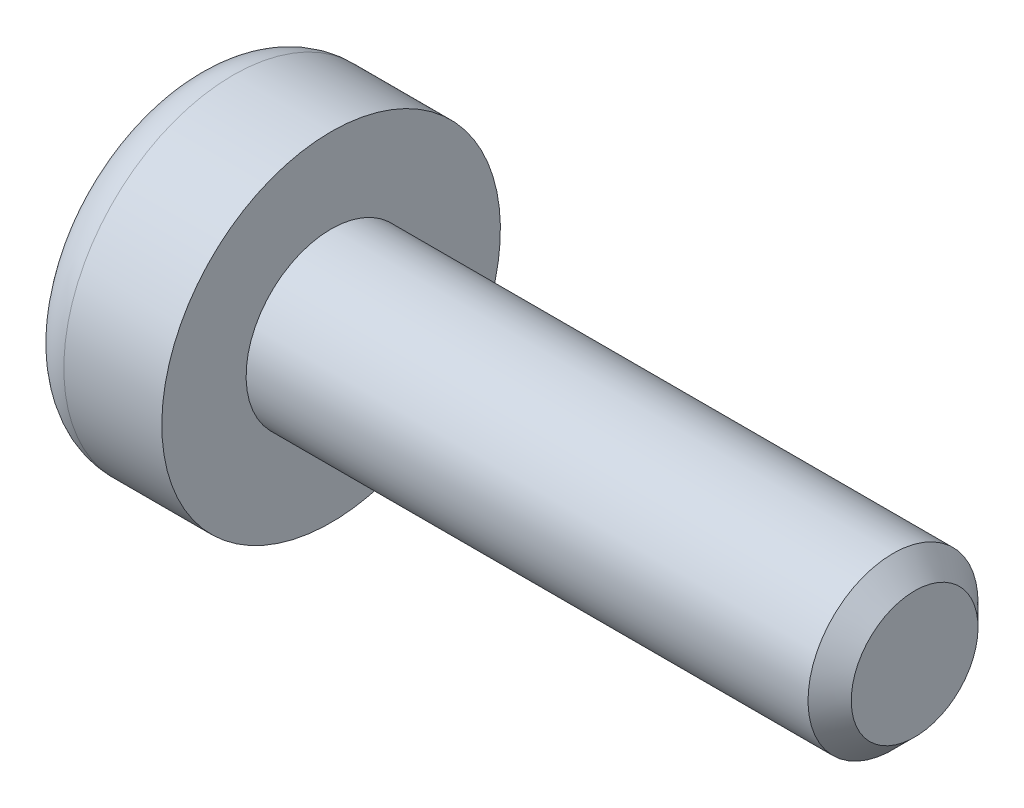
ISO-10303-21;
HEADER;
FILE_DESCRIPTION(('STEP AP214'),'2;1');
FILE_NAME('part.step','',(''),(''),'','','');
FILE_SCHEMA(('AUTOMOTIVE_DESIGN { 1 0 10303 214 1 1 1 1 }'));
ENDSEC;
DATA;
#1=APPLICATION_CONTEXT('core data for automotive mechanical design processes');
#2=APPLICATION_PROTOCOL_DEFINITION('international standard','automotive_design',2000,#1);
#3=PRODUCT_CONTEXT('',#1,'mechanical');
#4=PRODUCT('Part','Part','',(#3));
#5=PRODUCT_RELATED_PRODUCT_CATEGORY('part','',(#4));
#6=PRODUCT_DEFINITION_FORMATION('','',#4);
#7=PRODUCT_DEFINITION_CONTEXT('part definition',#1,'design');
#8=PRODUCT_DEFINITION('design','',#6,#7);
#9=PRODUCT_DEFINITION_SHAPE('','',#8);
#10=(LENGTH_UNIT() NAMED_UNIT(*) SI_UNIT(.MILLI.,.METRE.));
#11=(NAMED_UNIT(*) PLANE_ANGLE_UNIT() SI_UNIT($,.RADIAN.));
#12=(NAMED_UNIT(*) SI_UNIT($,.STERADIAN.) SOLID_ANGLE_UNIT());
#13=UNCERTAINTY_MEASURE_WITH_UNIT(LENGTH_MEASURE(1.E-05),#10,'distance_accuracy_value','');
#14=(GEOMETRIC_REPRESENTATION_CONTEXT(3) GLOBAL_UNCERTAINTY_ASSIGNED_CONTEXT((#13)) GLOBAL_UNIT_ASSIGNED_CONTEXT((#10,
#11,#12)) REPRESENTATION_CONTEXT('',''));
#15=CARTESIAN_POINT('',(0.,0.,0.));
#16=DIRECTION('',(0.,0.,1.));
#17=DIRECTION('',(1.,0.,0.));
#18=AXIS2_PLACEMENT_3D('',#15,#16,#17);
#19=CARTESIAN_POINT('',(0.,0.,0.));
#20=DIRECTION('',(1.,0.,0.));
#21=DIRECTION('',(0.,1.,0.));
#22=AXIS2_PLACEMENT_3D('',#19,#20,#21);
#23=PLANE('',#22);
#24=CARTESIAN_POINT('',(0.,0.,0.));
#25=DIRECTION('',(1.,0.,0.));
#26=DIRECTION('',(0.,1.,0.));
#27=AXIS2_PLACEMENT_3D('',#24,#25,#26);
#28=CIRCLE('',#27,1.1176);
#29=CARTESIAN_POINT('',(0.,1.1176,0.));
#30=VERTEX_POINT('',#29);
#31=EDGE_CURVE('E245',#30,#30,#28,.T.);
#32=ORIENTED_EDGE('',*,*,#31,.T.);
#33=EDGE_LOOP('',(#32));
#34=FACE_BOUND('',#33,.T.);
#35=ADVANCED_FACE('F42',(#34),#23,.T.);
#36=CARTESIAN_POINT('',(0.,0.,0.));
#37=DIRECTION('',(-1.,0.,0.));
#38=DIRECTION('',(0.,-1.,0.));
#39=AXIS2_PLACEMENT_3D('',#36,#37,#38);
#40=CONICAL_SURFACE('',#39,1.1176,0.785398163397448);
#41=CARTESIAN_POINT('',(-0.381,0.,0.));
#42=DIRECTION('',(1.,0.,0.));
#43=DIRECTION('',(0.,1.,0.));
#44=AXIS2_PLACEMENT_3D('',#41,#42,#43);
#45=CIRCLE('',#44,1.4986);
#46=CARTESIAN_POINT('',(-0.381,1.4986,0.));
#47=VERTEX_POINT('',#46);
#48=EDGE_CURVE('E241',#47,#47,#45,.T.);
#49=ORIENTED_EDGE('',*,*,#48,.T.);
#50=EDGE_LOOP('',(#49));
#51=FACE_BOUND('',#50,.T.);
#52=ORIENTED_EDGE('',*,*,#31,.F.);
#53=EDGE_LOOP('',(#52));
#54=FACE_BOUND('',#53,.T.);
#55=ADVANCED_FACE('F267',(#51,#54),#40,.T.);
#56=CARTESIAN_POINT('',(0.,0.,0.));
#57=DIRECTION('',(1.,0.,0.));
#58=DIRECTION('',(0.,1.,0.));
#59=AXIS2_PLACEMENT_3D('',#56,#57,#58);
#60=CYLINDRICAL_SURFACE('',#59,1.4986);
#61=CARTESIAN_POINT('',(-10.287,0.,0.));
#62=DIRECTION('',(1.,0.,0.));
#63=DIRECTION('',(0.,1.,0.));
#64=AXIS2_PLACEMENT_3D('',#61,#62,#63);
#65=CIRCLE('',#64,1.4986);
#66=CARTESIAN_POINT('',(-10.287,1.4986,0.));
#67=VERTEX_POINT('',#66);
#68=EDGE_CURVE('E237',#67,#67,#65,.T.);
#69=ORIENTED_EDGE('',*,*,#68,.T.);
#70=EDGE_LOOP('',(#69));
#71=FACE_BOUND('',#70,.T.);
#72=ORIENTED_EDGE('',*,*,#48,.F.);
#73=EDGE_LOOP('',(#72));
#74=FACE_BOUND('',#73,.T.);
#75=ADVANCED_FACE('F272',(#71,#74),#60,.T.);
#76=CARTESIAN_POINT('',(-10.287,2.9845,0.));
#77=DIRECTION('',(1.,0.,0.));
#78=DIRECTION('',(0.,1.,0.));
#79=AXIS2_PLACEMENT_3D('',#76,#77,#78);
#80=PLANE('',#79);
#81=CARTESIAN_POINT('',(-10.287,0.,0.));
#82=DIRECTION('',(1.,0.,0.));
#83=DIRECTION('',(0.,1.,0.));
#84=AXIS2_PLACEMENT_3D('',#81,#82,#83);
#85=CIRCLE('',#84,2.9845);
#86=CARTESIAN_POINT('',(-10.287,2.9845,0.));
#87=VERTEX_POINT('',#86);
#88=EDGE_CURVE('E233',#87,#87,#85,.T.);
#89=ORIENTED_EDGE('',*,*,#88,.T.);
#90=EDGE_LOOP('',(#89));
#91=FACE_BOUND('',#90,.T.);
#92=ORIENTED_EDGE('',*,*,#68,.F.);
#93=EDGE_LOOP('',(#92));
#94=FACE_BOUND('',#93,.T.);
#95=ADVANCED_FACE('F278',(#91,#94),#80,.T.);
#96=CARTESIAN_POINT('',(0.,0.,0.));
#97=DIRECTION('',(1.,0.,0.));
#98=DIRECTION('',(0.,1.,0.));
#99=AXIS2_PLACEMENT_3D('',#96,#97,#98);
#100=CYLINDRICAL_SURFACE('',#99,2.9845);
#101=CARTESIAN_POINT('',(-12.0142,0.,0.));
#102=DIRECTION('',(-1.,0.,0.));
#103=DIRECTION('',(0.,-1.,0.));
#104=AXIS2_PLACEMENT_3D('',#101,#102,#103);
#105=CIRCLE('',#104,2.9845);
#106=CARTESIAN_POINT('',(-12.0142,-2.9845,0.));
#107=VERTEX_POINT('',#106);
#108=EDGE_CURVE('E51',#107,#107,#105,.F.);
#109=ORIENTED_EDGE('',*,*,#108,.T.);
#110=EDGE_LOOP('',(#109));
#111=FACE_BOUND('',#110,.T.);
#112=ORIENTED_EDGE('',*,*,#88,.F.);
#113=EDGE_LOOP('',(#112));
#114=FACE_BOUND('',#113,.T.);
#115=ADVANCED_FACE('F252',(#111,#114),#100,.T.);
#116=CARTESIAN_POINT('',(-12.7762,0.,0.));
#117=DIRECTION('',(-1.,0.,0.));
#118=DIRECTION('',(0.,-1.,0.));
#119=AXIS2_PLACEMENT_3D('',#116,#117,#118);
#120=PLANE('',#119);
#121=DIRECTION('',(0.,0.,-1.));
#122=VECTOR('',#121,1.);
#123=CARTESIAN_POINT('',(-12.7762,0.380999999999998,-0.381));
#124=LINE('',#123,#122);
#125=CARTESIAN_POINT('',(-12.7762,0.380999999999998,-0.381));
#126=VERTEX_POINT('',#125);
#127=CARTESIAN_POINT('',(-12.7762,0.380999999999998,-1.905));
#128=VERTEX_POINT('',#127);
#129=EDGE_CURVE('E61',#126,#128,#124,.T.);
#130=ORIENTED_EDGE('',*,*,#129,.F.);
#131=DIRECTION('',(0.,-1.,0.));
#132=VECTOR('',#131,1.);
#133=CARTESIAN_POINT('',(-12.7762,1.905,-0.381));
#134=LINE('',#133,#132);
#135=CARTESIAN_POINT('',(-12.7762,1.905,-0.381));
#136=VERTEX_POINT('',#135);
#137=EDGE_CURVE('E185',#136,#126,#134,.T.);
#138=ORIENTED_EDGE('',*,*,#137,.F.);
#139=DIRECTION('',(0.,0.,-1.));
#140=VECTOR('',#139,1.);
#141=CARTESIAN_POINT('',(-12.7762,1.905,0.381));
#142=LINE('',#141,#140);
#143=CARTESIAN_POINT('',(-12.7762,1.905,0.381));
#144=VERTEX_POINT('',#143);
#145=EDGE_CURVE('E181',#144,#136,#142,.T.);
#146=ORIENTED_EDGE('',*,*,#145,.F.);
#147=DIRECTION('',(0.,1.,0.));
#148=VECTOR('',#147,1.);
#149=CARTESIAN_POINT('',(-12.7762,1.905,0.381));
#150=LINE('',#149,#148);
#151=CARTESIAN_POINT('',(-12.7762,0.380999999999998,0.381));
#152=VERTEX_POINT('',#151);
#153=EDGE_CURVE('E177',#152,#144,#150,.T.);
#154=ORIENTED_EDGE('',*,*,#153,.F.);
#155=DIRECTION('',(0.,0.,-1.));
#156=VECTOR('',#155,1.);
#157=CARTESIAN_POINT('',(-12.7762,0.380999999999999,1.905));
#158=LINE('',#157,#156);
#159=CARTESIAN_POINT('',(-12.7762,0.380999999999999,1.905));
#160=VERTEX_POINT('',#159);
#161=EDGE_CURVE('E173',#160,#152,#158,.T.);
#162=ORIENTED_EDGE('',*,*,#161,.F.);
#163=DIRECTION('',(0.,1.,0.));
#164=VECTOR('',#163,1.);
#165=CARTESIAN_POINT('',(-12.7762,-0.381000000000001,1.905));
#166=LINE('',#165,#164);
#167=CARTESIAN_POINT('',(-12.7762,-0.381000000000001,1.905));
#168=VERTEX_POINT('',#167);
#169=EDGE_CURVE('E169',#168,#160,#166,.T.);
#170=ORIENTED_EDGE('',*,*,#169,.F.);
#171=DIRECTION('',(0.,0.,1.));
#172=VECTOR('',#171,1.);
#173=CARTESIAN_POINT('',(-12.7762,-0.381000000000001,1.905));
#174=LINE('',#173,#172);
#175=CARTESIAN_POINT('',(-12.7762,-0.381000000000001,0.381));
#176=VERTEX_POINT('',#175);
#177=EDGE_CURVE('E165',#176,#168,#174,.T.);
#178=ORIENTED_EDGE('',*,*,#177,.F.);
#179=DIRECTION('',(0.,1.,0.));
#180=VECTOR('',#179,1.);
#181=CARTESIAN_POINT('',(-12.7762,-0.381000000000001,0.381));
#182=LINE('',#181,#180);
#183=CARTESIAN_POINT('',(-12.7762,-1.905,0.381));
#184=VERTEX_POINT('',#183);
#185=EDGE_CURVE('E161',#184,#176,#182,.T.);
#186=ORIENTED_EDGE('',*,*,#185,.F.);
#187=DIRECTION('',(0.,0.,1.));
#188=VECTOR('',#187,1.);
#189=CARTESIAN_POINT('',(-12.7762,-1.905,0.381));
#190=LINE('',#189,#188);
#191=CARTESIAN_POINT('',(-12.7762,-1.905,-0.381));
#192=VERTEX_POINT('',#191);
#193=EDGE_CURVE('E154',#192,#184,#190,.T.);
#194=ORIENTED_EDGE('',*,*,#193,.F.);
#195=DIRECTION('',(0.,-1.,0.));
#196=VECTOR('',#195,1.);
#197=CARTESIAN_POINT('',(-12.7762,-0.381000000000002,-0.381));
#198=LINE('',#197,#196);
#199=CARTESIAN_POINT('',(-12.7762,-0.381000000000002,-0.381));
#200=VERTEX_POINT('',#199);
#201=EDGE_CURVE('E149',#200,#192,#198,.T.);
#202=ORIENTED_EDGE('',*,*,#201,.F.);
#203=DIRECTION('',(0.,0.,1.));
#204=VECTOR('',#203,1.);
#205=CARTESIAN_POINT('',(-12.7762,-0.381000000000002,-0.381));
#206=LINE('',#205,#204);
#207=CARTESIAN_POINT('',(-12.7762,-0.381000000000002,-1.905));
#208=VERTEX_POINT('',#207);
#209=EDGE_CURVE('E132',#208,#200,#206,.T.);
#210=ORIENTED_EDGE('',*,*,#209,.F.);
#211=DIRECTION('',(0.,-1.,0.));
#212=VECTOR('',#211,1.);
#213=CARTESIAN_POINT('',(-12.7762,-0.381000000000002,-1.905));
#214=LINE('',#213,#212);
#215=EDGE_CURVE('E140',#128,#208,#214,.T.);
#216=ORIENTED_EDGE('',*,*,#215,.F.);
#217=EDGE_LOOP('',(#130,#138,#146,#154,#162,#170,#178,#186,#194,#202,#210,#216));
#218=FACE_BOUND('',#217,.T.);
#219=CARTESIAN_POINT('',(-12.7762,0.,0.));
#220=DIRECTION('',(-1.,0.,0.));
#221=DIRECTION('',(0.,-1.,0.));
#222=AXIS2_PLACEMENT_3D('',#219,#220,#221);
#223=CIRCLE('',#222,2.2225);
#224=CARTESIAN_POINT('',(-12.7762,-2.2225,0.));
#225=VERTEX_POINT('',#224);
#226=EDGE_CURVE('E11',#225,#225,#223,.T.);
#227=ORIENTED_EDGE('',*,*,#226,.T.);
#228=EDGE_LOOP('',(#227));
#229=FACE_BOUND('',#228,.T.);
#230=ADVANCED_FACE('F145',(#218,#229),#120,.T.);
#231=CARTESIAN_POINT('',(-12.0142,0.,0.));
#232=DIRECTION('',(-1.,0.,0.));
#233=DIRECTION('',(0.,-1.,0.));
#234=AXIS2_PLACEMENT_3D('',#231,#232,#233);
#235=TOROIDAL_SURFACE('',#234,2.2225,0.762);
#236=ORIENTED_EDGE('',*,*,#226,.F.);
#237=EDGE_LOOP('',(#236));
#238=FACE_BOUND('',#237,.T.);
#239=ORIENTED_EDGE('',*,*,#108,.F.);
#240=EDGE_LOOP('',(#239));
#241=FACE_BOUND('',#240,.T.);
#242=ADVANCED_FACE('F44',(#238,#241),#235,.T.);
#243=CARTESIAN_POINT('',(-12.7762,0.380999999999998,-0.381));
#244=DIRECTION('',(0.707106781186549,0.707106781186546,0.));
#245=DIRECTION('',(-0.707106781186546,0.707106781186549,0.));
#246=AXIS2_PLACEMENT_3D('',#243,#244,#245);
#247=PLANE('',#246);
#248=DIRECTION('',(0.,0.,1.));
#249=VECTOR('',#248,1.);
#250=CARTESIAN_POINT('',(-12.3952,0.,-0.381));
#251=LINE('',#250,#249);
#252=CARTESIAN_POINT('',(-12.3952,0.,-1.524));
#253=VERTEX_POINT('',#252);
#254=CARTESIAN_POINT('',(-12.3952,0.,0.));
#255=VERTEX_POINT('',#254);
#256=EDGE_CURVE('E69',#253,#255,#251,.T.);
#257=ORIENTED_EDGE('',*,*,#256,.T.);
#258=DIRECTION('',(-0.577350269189624,0.577350269189626,-0.577350269189627));
#259=VECTOR('',#258,1.);
#260=CARTESIAN_POINT('',(-12.7762,0.380999999999998,-0.381));
#261=LINE('',#260,#259);
#262=EDGE_CURVE('E189',#255,#126,#261,.T.);
#263=ORIENTED_EDGE('',*,*,#262,.T.);
#264=ORIENTED_EDGE('',*,*,#129,.T.);
#265=DIRECTION('',(-0.577350269189625,0.577350269189626,-0.577350269189627));
#266=VECTOR('',#265,1.);
#267=CARTESIAN_POINT('',(-12.2682,-0.127000000000003,-1.397));
#268=LINE('',#267,#266);
#269=EDGE_CURVE('E137',#253,#128,#268,.T.);
#270=ORIENTED_EDGE('',*,*,#269,.F.);
#271=EDGE_LOOP('',(#257,#263,#264,#270));
#272=FACE_BOUND('',#271,.T.);
#273=ADVANCED_FACE('F256',(#272),#247,.F.);
#274=CARTESIAN_POINT('',(-12.7762,1.905,-0.381));
#275=DIRECTION('',(0.707106781186549,0.,-0.707106781186546));
#276=DIRECTION('',(-0.707106781186546,0.,-0.707106781186549));
#277=AXIS2_PLACEMENT_3D('',#274,#275,#276);
#278=PLANE('',#277);
#279=DIRECTION('',(-0.577350269189624,0.577350269189626,-0.577350269189627));
#280=VECTOR('',#279,1.);
#281=CARTESIAN_POINT('',(-12.5222,1.651,-0.126999999999999));
#282=LINE('',#281,#280);
#283=CARTESIAN_POINT('',(-12.3952,1.524,0.));
#284=VERTEX_POINT('',#283);
#285=EDGE_CURVE('E193',#284,#136,#282,.T.);
#286=ORIENTED_EDGE('',*,*,#285,.T.);
#287=ORIENTED_EDGE('',*,*,#137,.T.);
#288=ORIENTED_EDGE('',*,*,#262,.F.);
#289=DIRECTION('',(0.,-1.,0.));
#290=VECTOR('',#289,1.);
#291=CARTESIAN_POINT('',(-12.3952,1.905,0.));
#292=LINE('',#291,#290);
#293=EDGE_CURVE('E192',#284,#255,#292,.T.);
#294=ORIENTED_EDGE('',*,*,#293,.F.);
#295=EDGE_LOOP('',(#286,#287,#288,#294));
#296=FACE_BOUND('',#295,.T.);
#297=ADVANCED_FACE('F262',(#296),#278,.F.);
#298=CARTESIAN_POINT('',(-12.7762,1.905,0.381));
#299=DIRECTION('',(0.707106781186549,0.707106781186546,0.));
#300=DIRECTION('',(-0.707106781186546,0.707106781186549,0.));
#301=AXIS2_PLACEMENT_3D('',#298,#299,#300);
#302=PLANE('',#301);
#303=ORIENTED_EDGE('',*,*,#145,.T.);
#304=ORIENTED_EDGE('',*,*,#285,.F.);
#305=DIRECTION('',(-0.577350269189624,0.577350269189626,0.577350269189626));
#306=VECTOR('',#305,1.);
#307=CARTESIAN_POINT('',(-12.7762,1.905,0.381));
#308=LINE('',#307,#306);
#309=EDGE_CURVE('E216',#284,#144,#308,.T.);
#310=ORIENTED_EDGE('',*,*,#309,.T.);
#311=EDGE_LOOP('',(#303,#304,#310));
#312=FACE_BOUND('',#311,.T.);
#313=ADVANCED_FACE('F287',(#312),#302,.F.);
#314=CARTESIAN_POINT('',(-12.7762,1.905,0.381));
#315=DIRECTION('',(0.707106781186549,0.,0.707106781186546));
#316=DIRECTION('',(0.707106781186546,0.,-0.707106781186549));
#317=AXIS2_PLACEMENT_3D('',#314,#315,#316);
#318=PLANE('',#317);
#319=ORIENTED_EDGE('',*,*,#293,.T.);
#320=DIRECTION('',(-0.577350269189625,0.577350269189627,0.577350269189627));
#321=VECTOR('',#320,1.);
#322=CARTESIAN_POINT('',(-13.2842,0.888999999999999,0.889000000000001));
#323=LINE('',#322,#321);
#324=EDGE_CURVE('E213',#255,#152,#323,.T.);
#325=ORIENTED_EDGE('',*,*,#324,.T.);
#326=ORIENTED_EDGE('',*,*,#153,.T.);
#327=ORIENTED_EDGE('',*,*,#309,.F.);
#328=EDGE_LOOP('',(#319,#325,#326,#327));
#329=FACE_BOUND('',#328,.T.);
#330=ADVANCED_FACE('F291',(#329),#318,.F.);
#331=CARTESIAN_POINT('',(-12.7762,0.380999999999999,1.905));
#332=DIRECTION('',(0.707106781186549,0.707106781186546,0.));
#333=DIRECTION('',(-0.707106781186546,0.707106781186549,0.));
#334=AXIS2_PLACEMENT_3D('',#331,#332,#333);
#335=PLANE('',#334);
#336=DIRECTION('',(-0.577350269189624,0.577350269189626,0.577350269189627));
#337=VECTOR('',#336,1.);
#338=CARTESIAN_POINT('',(-12.5222,0.126999999999998,1.651));
#339=LINE('',#338,#337);
#340=CARTESIAN_POINT('',(-12.3952,0.,1.524));
#341=VERTEX_POINT('',#340);
#342=EDGE_CURVE('E210',#341,#160,#339,.T.);
#343=ORIENTED_EDGE('',*,*,#342,.T.);
#344=ORIENTED_EDGE('',*,*,#161,.T.);
#345=ORIENTED_EDGE('',*,*,#324,.F.);
#346=DIRECTION('',(0.,0.,-1.));
#347=VECTOR('',#346,1.);
#348=CARTESIAN_POINT('',(-12.3952,0.,1.905));
#349=LINE('',#348,#347);
#350=EDGE_CURVE('E224',#341,#255,#349,.T.);
#351=ORIENTED_EDGE('',*,*,#350,.F.);
#352=EDGE_LOOP('',(#343,#344,#345,#351));
#353=FACE_BOUND('',#352,.T.);
#354=ADVANCED_FACE('F295',(#353),#335,.F.);
#355=CARTESIAN_POINT('',(-12.7762,-0.381000000000001,1.905));
#356=DIRECTION('',(0.707106781186549,0.,0.707106781186546));
#357=DIRECTION('',(0.707106781186546,0.,-0.707106781186549));
#358=AXIS2_PLACEMENT_3D('',#355,#356,#357);
#359=PLANE('',#358);
#360=ORIENTED_EDGE('',*,*,#169,.T.);
#361=ORIENTED_EDGE('',*,*,#342,.F.);
#362=DIRECTION('',(-0.577350269189624,-0.577350269189627,0.577350269189626));
#363=VECTOR('',#362,1.);
#364=CARTESIAN_POINT('',(-12.7762,-0.381000000000001,1.905));
#365=LINE('',#364,#363);
#366=EDGE_CURVE('E207',#341,#168,#365,.T.);
#367=ORIENTED_EDGE('',*,*,#366,.T.);
#368=EDGE_LOOP('',(#360,#361,#367));
#369=FACE_BOUND('',#368,.T.);
#370=ADVANCED_FACE('F299',(#369),#359,.F.);
#371=CARTESIAN_POINT('',(-12.7762,-0.381000000000001,1.905));
#372=DIRECTION('',(0.707106781186549,-0.707106781186546,0.));
#373=DIRECTION('',(0.707106781186546,0.707106781186549,0.));
#374=AXIS2_PLACEMENT_3D('',#371,#372,#373);
#375=PLANE('',#374);
#376=ORIENTED_EDGE('',*,*,#350,.T.);
#377=DIRECTION('',(-0.577350269189624,-0.577350269189627,0.577350269189627));
#378=VECTOR('',#377,1.);
#379=CARTESIAN_POINT('',(-13.2842,-0.889000000000002,0.889000000000001));
#380=LINE('',#379,#378);
#381=EDGE_CURVE('E204',#255,#176,#380,.T.);
#382=ORIENTED_EDGE('',*,*,#381,.T.);
#383=ORIENTED_EDGE('',*,*,#177,.T.);
#384=ORIENTED_EDGE('',*,*,#366,.F.);
#385=EDGE_LOOP('',(#376,#382,#383,#384));
#386=FACE_BOUND('',#385,.T.);
#387=ADVANCED_FACE('F303',(#386),#375,.F.);
#388=CARTESIAN_POINT('',(-12.7762,-0.381000000000001,0.381));
#389=DIRECTION('',(0.707106781186549,0.,0.707106781186546));
#390=DIRECTION('',(0.707106781186546,0.,-0.707106781186549));
#391=AXIS2_PLACEMENT_3D('',#388,#389,#390);
#392=PLANE('',#391);
#393=DIRECTION('',(-0.577350269189624,-0.577350269189627,0.577350269189626));
#394=VECTOR('',#393,1.);
#395=CARTESIAN_POINT('',(-12.7762,-1.905,0.381));
#396=LINE('',#395,#394);
#397=CARTESIAN_POINT('',(-12.3952,-1.524,0.));
#398=VERTEX_POINT('',#397);
#399=EDGE_CURVE('E201',#398,#184,#396,.T.);
#400=ORIENTED_EDGE('',*,*,#399,.T.);
#401=ORIENTED_EDGE('',*,*,#185,.T.);
#402=ORIENTED_EDGE('',*,*,#381,.F.);
#403=DIRECTION('',(0.,1.,0.));
#404=VECTOR('',#403,1.);
#405=CARTESIAN_POINT('',(-12.3952,-0.381000000000001,0.));
#406=LINE('',#405,#404);
#407=EDGE_CURVE('E228',#398,#255,#406,.T.);
#408=ORIENTED_EDGE('',*,*,#407,.F.);
#409=EDGE_LOOP('',(#400,#401,#402,#408));
#410=FACE_BOUND('',#409,.T.);
#411=ADVANCED_FACE('F307',(#410),#392,.F.);
#412=CARTESIAN_POINT('',(-12.7762,-1.905,0.381));
#413=DIRECTION('',(0.707106781186549,-0.707106781186546,0.));
#414=DIRECTION('',(0.707106781186546,0.707106781186549,0.));
#415=AXIS2_PLACEMENT_3D('',#412,#413,#414);
#416=PLANE('',#415);
#417=ORIENTED_EDGE('',*,*,#193,.T.);
#418=ORIENTED_EDGE('',*,*,#399,.F.);
#419=DIRECTION('',(-0.577350269189624,-0.577350269189627,-0.577350269189627));
#420=VECTOR('',#419,1.);
#421=CARTESIAN_POINT('',(-12.2682,-1.397,0.127000000000001));
#422=LINE('',#421,#420);
#423=EDGE_CURVE('E198',#398,#192,#422,.T.);
#424=ORIENTED_EDGE('',*,*,#423,.T.);
#425=EDGE_LOOP('',(#417,#418,#424));
#426=FACE_BOUND('',#425,.T.);
#427=ADVANCED_FACE('F311',(#426),#416,.F.);
#428=CARTESIAN_POINT('',(-12.7762,-0.381000000000002,-0.381));
#429=DIRECTION('',(0.707106781186549,0.,-0.707106781186546));
#430=DIRECTION('',(-0.707106781186546,0.,-0.707106781186549));
#431=AXIS2_PLACEMENT_3D('',#428,#429,#430);
#432=PLANE('',#431);
#433=ORIENTED_EDGE('',*,*,#407,.T.);
#434=DIRECTION('',(-0.577350269189624,-0.577350269189627,-0.577350269189627));
#435=VECTOR('',#434,1.);
#436=CARTESIAN_POINT('',(-12.7762,-0.381000000000002,-0.381));
#437=LINE('',#436,#435);
#438=EDGE_CURVE('E136',#255,#200,#437,.T.);
#439=ORIENTED_EDGE('',*,*,#438,.T.);
#440=ORIENTED_EDGE('',*,*,#201,.T.);
#441=ORIENTED_EDGE('',*,*,#423,.F.);
#442=EDGE_LOOP('',(#433,#439,#440,#441));
#443=FACE_BOUND('',#442,.T.);
#444=ADVANCED_FACE('F315',(#443),#432,.F.);
#445=CARTESIAN_POINT('',(-12.7762,-0.381000000000002,-0.381));
#446=DIRECTION('',(0.707106781186549,-0.707106781186546,0.));
#447=DIRECTION('',(0.707106781186546,0.707106781186549,0.));
#448=AXIS2_PLACEMENT_3D('',#445,#446,#447);
#449=PLANE('',#448);
#450=DIRECTION('',(-0.577350269189624,-0.577350269189627,-0.577350269189626));
#451=VECTOR('',#450,1.);
#452=CARTESIAN_POINT('',(-12.7762,-0.381000000000002,-1.905));
#453=LINE('',#452,#451);
#454=EDGE_CURVE('E127',#253,#208,#453,.T.);
#455=ORIENTED_EDGE('',*,*,#454,.T.);
#456=ORIENTED_EDGE('',*,*,#209,.T.);
#457=ORIENTED_EDGE('',*,*,#438,.F.);
#458=ORIENTED_EDGE('',*,*,#256,.F.);
#459=EDGE_LOOP('',(#455,#456,#457,#458));
#460=FACE_BOUND('',#459,.T.);
#461=ADVANCED_FACE('F129',(#460),#449,.F.);
#462=CARTESIAN_POINT('',(-12.7762,-0.381000000000002,-1.905));
#463=DIRECTION('',(0.707106781186549,0.,-0.707106781186546));
#464=DIRECTION('',(-0.707106781186546,0.,-0.707106781186549));
#465=AXIS2_PLACEMENT_3D('',#462,#463,#464);
#466=PLANE('',#465);
#467=ORIENTED_EDGE('',*,*,#215,.T.);
#468=ORIENTED_EDGE('',*,*,#454,.F.);
#469=ORIENTED_EDGE('',*,*,#269,.T.);
#470=EDGE_LOOP('',(#467,#468,#469));
#471=FACE_BOUND('',#470,.T.);
#472=ADVANCED_FACE('F141',(#471),#466,.F.);
#473=CLOSED_SHELL('',(#35,#55,#75,#95,#115,#230,#242,#273,#297,#313,#330,#354,#370,#387,#411,
#427,#444,#461,#472));
#474=MANIFOLD_SOLID_BREP('B2',#473);
#475=ADVANCED_BREP_SHAPE_REPRESENTATION('',(#18,#474),#14);
#476=SHAPE_DEFINITION_REPRESENTATION(#9,#475);
ENDSEC;
END-ISO-10303-21;
